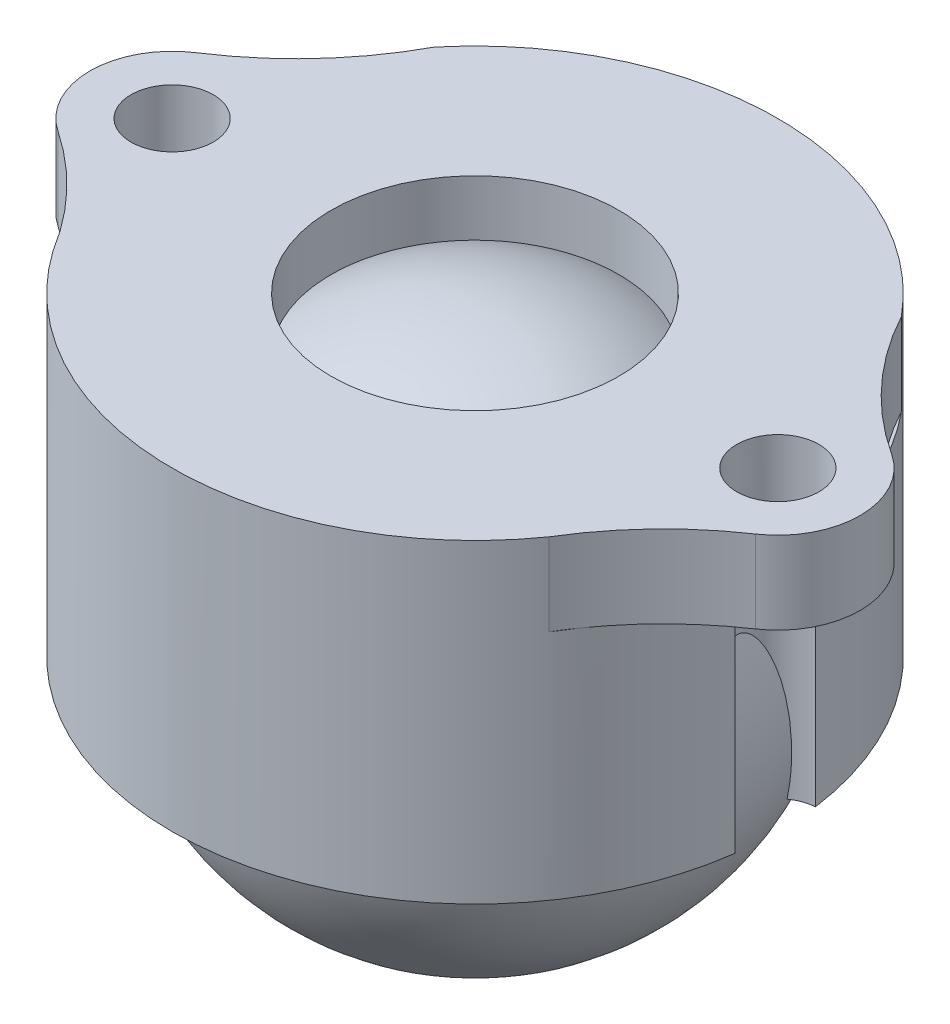
ISO-10303-21;
HEADER;
FILE_DESCRIPTION(('STEP AP214'),'2;1');
FILE_NAME('part.step','',(''),(''),'','','');
FILE_SCHEMA(('AUTOMOTIVE_DESIGN { 1 0 10303 214 1 1 1 1 }'));
ENDSEC;
DATA;
#1=APPLICATION_CONTEXT('core data for automotive mechanical design processes');
#2=APPLICATION_PROTOCOL_DEFINITION('international standard','automotive_design',2000,#1);
#3=PRODUCT_CONTEXT('',#1,'mechanical');
#4=PRODUCT('Part','Part','',(#3));
#5=PRODUCT_RELATED_PRODUCT_CATEGORY('part','',(#4));
#6=PRODUCT_DEFINITION_FORMATION('','',#4);
#7=PRODUCT_DEFINITION_CONTEXT('part definition',#1,'design');
#8=PRODUCT_DEFINITION('design','',#6,#7);
#9=PRODUCT_DEFINITION_SHAPE('','',#8);
#10=(LENGTH_UNIT() NAMED_UNIT(*) SI_UNIT(.MILLI.,.METRE.));
#11=(NAMED_UNIT(*) PLANE_ANGLE_UNIT() SI_UNIT($,.RADIAN.));
#12=(NAMED_UNIT(*) SI_UNIT($,.STERADIAN.) SOLID_ANGLE_UNIT());
#13=UNCERTAINTY_MEASURE_WITH_UNIT(LENGTH_MEASURE(1.E-05),#10,'distance_accuracy_value','');
#14=(GEOMETRIC_REPRESENTATION_CONTEXT(3) GLOBAL_UNCERTAINTY_ASSIGNED_CONTEXT((#13)) GLOBAL_UNIT_ASSIGNED_CONTEXT((#10,
#11,#12)) REPRESENTATION_CONTEXT('',''));
#15=CARTESIAN_POINT('',(0.,0.,0.));
#16=DIRECTION('',(0.,0.,1.));
#17=DIRECTION('',(1.,0.,0.));
#18=AXIS2_PLACEMENT_3D('',#15,#16,#17);
#19=CARTESIAN_POINT('',(-6.83910863974937,-1.008210810104,0.));
#20=DIRECTION('',(0.,-1.,0.));
#21=DIRECTION('',(0.,0.,-1.));
#22=AXIS2_PLACEMENT_3D('',#19,#20,#21);
#23=PLANE('',#22);
#24=CARTESIAN_POINT('',(7.366,-1.008210810104,0.));
#25=DIRECTION('',(0.,-1.,0.));
#26=DIRECTION('',(0.,0.,-1.));
#27=AXIS2_PLACEMENT_3D('',#24,#25,#26);
#28=CIRCLE('',#27,0.982088665650923);
#29=CARTESIAN_POINT('',(6.79248335861352,-1.008210810104,0.797230712687852));
#30=VERTEX_POINT('',#29);
#31=CARTESIAN_POINT('',(7.3005304,-1.008210810104,0.979904015032004));
#32=VERTEX_POINT('',#31);
#33=EDGE_CURVE('E165',#30,#32,#28,.F.);
#34=ORIENTED_EDGE('',*,*,#33,.T.);
#35=CARTESIAN_POINT('',(0.,-1.008210810104,0.));
#36=DIRECTION('',(0.,1.,0.));
#37=DIRECTION('',(0.,0.,1.));
#38=AXIS2_PLACEMENT_3D('',#35,#36,#37);
#39=CIRCLE('',#38,7.366);
#40=CARTESIAN_POINT('',(-7.29812055389628,-1.008210810104,0.997693530497546));
#41=VERTEX_POINT('',#40);
#42=EDGE_CURVE('E178',#41,#32,#39,.T.);
#43=ORIENTED_EDGE('',*,*,#42,.F.);
#44=CARTESIAN_POINT('',(-7.366,-1.008210810104,0.));
#45=DIRECTION('',(0.,-1.,0.));
#46=DIRECTION('',(0.,0.,-1.));
#47=AXIS2_PLACEMENT_3D('',#44,#45,#46);
#48=CIRCLE('',#47,1.);
#49=CARTESIAN_POINT('',(-6.7900735125098,-1.008210810104,0.817501486853212));
#50=VERTEX_POINT('',#49);
#51=EDGE_CURVE('E425',#41,#50,#48,.F.);
#52=ORIENTED_EDGE('',*,*,#51,.T.);
#53=CARTESIAN_POINT('',(0.,-1.008210810104,0.));
#54=DIRECTION('',(0.,1.,0.));
#55=DIRECTION('',(0.,0.,1.));
#56=AXIS2_PLACEMENT_3D('',#53,#54,#55);
#57=CIRCLE('',#56,6.83910863974937);
#58=EDGE_CURVE('E190',#50,#30,#57,.T.);
#59=ORIENTED_EDGE('',*,*,#58,.T.);
#60=EDGE_LOOP('',(#34,#43,#52,#59));
#61=FACE_BOUND('',#60,.T.);
#62=ADVANCED_FACE('F39',(#61),#23,.T.);
#63=CARTESIAN_POINT('',(0.,6.35,0.));
#64=DIRECTION('',(0.,1.,0.));
#65=DIRECTION('',(0.,0.,1.));
#66=AXIS2_PLACEMENT_3D('',#63,#64,#65);
#67=CYLINDRICAL_SURFACE('',#66,7.366);
#68=DIRECTION('',(0.,1.,0.));
#69=VECTOR('',#68,1.);
#70=CARTESIAN_POINT('',(7.3005304,2.820894594948,-0.979904015032012));
#71=LINE('',#70,#69);
#72=CARTESIAN_POINT('',(7.3005304,-1.008210810104,-0.979904015032012));
#73=VERTEX_POINT('',#72);
#74=CARTESIAN_POINT('',(7.3005304,4.65,-0.979904015032016));
#75=VERTEX_POINT('',#74);
#76=EDGE_CURVE('E12',#73,#75,#71,.T.);
#77=ORIENTED_EDGE('',*,*,#76,.F.);
#78=CARTESIAN_POINT('',(-7.29812055389628,-1.008210810104,-0.997693530497546));
#79=VERTEX_POINT('',#78);
#80=EDGE_CURVE('E170',#73,#79,#39,.T.);
#81=ORIENTED_EDGE('',*,*,#80,.T.);
#82=DIRECTION('',(0.,1.,0.));
#83=VECTOR('',#82,1.);
#84=CARTESIAN_POINT('',(-7.29812055389628,2.820894594948,-0.997693530497546));
#85=LINE('',#84,#83);
#86=CARTESIAN_POINT('',(-7.29812055389628,4.65,-0.997693530497544));
#87=VERTEX_POINT('',#86);
#88=EDGE_CURVE('E424',#87,#79,#85,.F.);
#89=ORIENTED_EDGE('',*,*,#88,.F.);
#90=CARTESIAN_POINT('',(0.,4.65,0.));
#91=DIRECTION('',(0.,1.,0.));
#92=DIRECTION('',(0.,0.,1.));
#93=AXIS2_PLACEMENT_3D('',#90,#91,#92);
#94=CIRCLE('',#93,7.366);
#95=CARTESIAN_POINT('',(-6.52433929149894,4.65,-3.41920353436339));
#96=VERTEX_POINT('',#95);
#97=EDGE_CURVE('E215',#96,#87,#94,.T.);
#98=ORIENTED_EDGE('',*,*,#97,.F.);
#99=CARTESIAN_POINT('',(-5.67747566297735,4.65,-4.69299755980119));
#100=VERTEX_POINT('',#99);
#101=EDGE_CURVE('E212',#100,#96,#94,.T.);
#102=ORIENTED_EDGE('',*,*,#101,.F.);
#103=DIRECTION('',(0.,-1.,0.));
#104=VECTOR('',#103,1.);
#105=CARTESIAN_POINT('',(-5.67747566297735,6.65,-4.69299755980119));
#106=LINE('',#105,#104);
#107=CARTESIAN_POINT('',(-5.67747566297735,6.65,-4.69299755980119));
#108=VERTEX_POINT('',#107);
#109=EDGE_CURVE('E264',#108,#100,#106,.T.);
#110=ORIENTED_EDGE('',*,*,#109,.F.);
#111=CARTESIAN_POINT('',(0.,6.65,0.));
#112=DIRECTION('',(0.,1.,0.));
#113=DIRECTION('',(0.,0.,1.));
#114=AXIS2_PLACEMENT_3D('',#111,#112,#113);
#115=CIRCLE('',#114,7.366);
#116=CARTESIAN_POINT('',(5.67747566297735,6.65,-4.69299755980119));
#117=VERTEX_POINT('',#116);
#118=EDGE_CURVE('E262',#117,#108,#115,.T.);
#119=ORIENTED_EDGE('',*,*,#118,.F.);
#120=DIRECTION('',(0.,-1.,0.));
#121=VECTOR('',#120,1.);
#122=CARTESIAN_POINT('',(5.67747566297735,6.65,-4.69299755980119));
#123=LINE('',#122,#121);
#124=CARTESIAN_POINT('',(5.67747566297735,4.65,-4.69299755980119));
#125=VERTEX_POINT('',#124);
#126=EDGE_CURVE('E253',#117,#125,#123,.T.);
#127=ORIENTED_EDGE('',*,*,#126,.T.);
#128=CARTESIAN_POINT('',(6.52433929149894,4.65,-3.41920353436339));
#129=VERTEX_POINT('',#128);
#130=EDGE_CURVE('E209',#129,#125,#94,.T.);
#131=ORIENTED_EDGE('',*,*,#130,.F.);
#132=CARTESIAN_POINT('',(7.29812055389628,4.65,-0.997693530497546));
#133=VERTEX_POINT('',#132);
#134=EDGE_CURVE('E206',#133,#129,#94,.T.);
#135=ORIENTED_EDGE('',*,*,#134,.F.);
#136=EDGE_CURVE('E173',#75,#133,#94,.T.);
#137=ORIENTED_EDGE('',*,*,#136,.F.);
#138=EDGE_LOOP('',(#77,#81,#89,#98,#102,#110,#119,#127,#131,#135,#137));
#139=FACE_BOUND('',#138,.T.);
#140=ADVANCED_FACE('F169',(#139),#67,.T.);
#141=CARTESIAN_POINT('',(-7.366,4.65,0.));
#142=DIRECTION('',(0.,1.,0.));
#143=DIRECTION('',(0.,0.,1.));
#144=AXIS2_PLACEMENT_3D('',#141,#142,#143);
#145=PLANE('',#144);
#146=CARTESIAN_POINT('',(-12.9690707269742,4.65,-8.62230005406383));
#147=DIRECTION('',(0.,-1.,0.));
#148=DIRECTION('',(0.,0.,1.));
#149=AXIS2_PLACEMENT_3D('',#146,#147,#148);
#150=CIRCLE('',#149,8.28292078126563);
#151=EDGE_CURVE('E306',#100,#96,#150,.T.);
#152=ORIENTED_EDGE('',*,*,#151,.F.);
#153=ORIENTED_EDGE('',*,*,#101,.T.);
#154=EDGE_LOOP('',(#152,#153));
#155=FACE_BOUND('',#154,.T.);
#156=ADVANCED_FACE('F405',(#155),#145,.T.);
#157=CARTESIAN_POINT('',(12.9690707269742,4.65,-8.62230005406384));
#158=DIRECTION('',(0.,-1.,0.));
#159=DIRECTION('',(0.,0.,-1.));
#160=AXIS2_PLACEMENT_3D('',#157,#158,#159);
#161=CIRCLE('',#160,8.28292078126563);
#162=EDGE_CURVE('E225',#129,#125,#161,.T.);
#163=ORIENTED_EDGE('',*,*,#162,.F.);
#164=ORIENTED_EDGE('',*,*,#130,.T.);
#165=EDGE_LOOP('',(#163,#164));
#166=FACE_BOUND('',#165,.T.);
#167=ADVANCED_FACE('F265',(#166),#145,.T.);
#168=CARTESIAN_POINT('',(13.1103055993483,4.65,8.52885765944539));
#169=DIRECTION('',(0.,-1.,0.));
#170=DIRECTION('',(0.,0.,1.));
#171=AXIS2_PLACEMENT_3D('',#168,#169,#170);
#172=CIRCLE('',#171,8.28292078126562);
#173=CARTESIAN_POINT('',(6.02995004834117,4.65,4.23056242295399));
#174=VERTEX_POINT('',#173);
#175=CARTESIAN_POINT('',(6.31134136356854,4.65,3.79801608639416));
#176=VERTEX_POINT('',#175);
#177=EDGE_CURVE('E238',#174,#176,#172,.T.);
#178=ORIENTED_EDGE('',*,*,#177,.F.);
#179=EDGE_CURVE('E179',#174,#176,#94,.T.);
#180=ORIENTED_EDGE('',*,*,#179,.T.);
#181=EDGE_LOOP('',(#178,#180));
#182=FACE_BOUND('',#181,.T.);
#183=ADVANCED_FACE('F454',(#182),#145,.T.);
#184=CARTESIAN_POINT('',(7.366,4.65,0.));
#185=DIRECTION('',(0.,1.,0.));
#186=DIRECTION('',(0.,0.,1.));
#187=AXIS2_PLACEMENT_3D('',#184,#185,#186);
#188=CIRCLE('',#187,0.982088665650923);
#189=CARTESIAN_POINT('',(7.3005304,4.65,0.979904015032004));
#190=VERTEX_POINT('',#189);
#191=EDGE_CURVE('E54',#75,#190,#188,.T.);
#192=ORIENTED_EDGE('',*,*,#191,.F.);
#193=ORIENTED_EDGE('',*,*,#136,.T.);
#194=CARTESIAN_POINT('',(7.366,4.65,0.));
#195=DIRECTION('',(0.,1.,0.));
#196=DIRECTION('',(0.,0.,-1.));
#197=AXIS2_PLACEMENT_3D('',#194,#195,#196);
#198=CIRCLE('',#197,1.);
#199=CARTESIAN_POINT('',(7.29812055389628,4.65,0.997693530497541));
#200=VERTEX_POINT('',#199);
#201=EDGE_CURVE('E335',#133,#200,#198,.T.);
#202=ORIENTED_EDGE('',*,*,#201,.T.);
#203=EDGE_CURVE('E203',#200,#190,#94,.T.);
#204=ORIENTED_EDGE('',*,*,#203,.T.);
#205=EDGE_LOOP('',(#192,#193,#202,#204));
#206=FACE_BOUND('',#205,.T.);
#207=ADVANCED_FACE('F406',(#206),#145,.T.);
#208=CARTESIAN_POINT('',(0.,0.,0.));
#209=DIRECTION('',(0.,1.,0.));
#210=DIRECTION('',(-1.,0.,0.));
#211=AXIS2_PLACEMENT_3D('',#208,#209,#210);
#212=SPHERICAL_SURFACE('',#211,6.91302365278067);
#213=CARTESIAN_POINT('',(6.79245598118181,-1.00841081010399,0.79721101703243));
#214=CARTESIAN_POINT('',(6.80364530632527,-0.926705677484879,0.805232688908091));
#215=CARTESIAN_POINT('',(6.8135082430222,-0.844704379796934,0.81199979153664));
#216=CARTESIAN_POINT('',(6.83052664889354,-0.68027806432814,0.823336415411445));
#217=CARTESIAN_POINT('',(6.83768241814655,-0.597853094536855,0.827906180238978));
#218=CARTESIAN_POINT('',(6.84924081818927,-0.432636735810129,0.835165417481351));
#219=CARTESIAN_POINT('',(6.85364033466358,-0.349845038451591,0.83785276333693));
#220=CARTESIAN_POINT('',(6.85964695265033,-0.184120208180288,0.84149740848753));
#221=CARTESIAN_POINT('',(6.86125396906029,-0.101187071034188,0.842454655057167));
#222=CARTESIAN_POINT('',(6.86166709460524,0.0655495387035506,0.842701802059498));
#223=CARTESIAN_POINT('',(6.86044395832455,0.14935311014109,0.841974292985238));
#224=CARTESIAN_POINT('',(6.85514397649867,0.316836333162014,0.838769323030744));
#225=CARTESIAN_POINT('',(6.85106715404747,0.400515985742743,0.836291876312218));
#226=CARTESIAN_POINT('',(6.84008978927661,0.567558046508765,0.829432686761025));
#227=CARTESIAN_POINT('',(6.83319109075042,0.650920626038043,0.825052187253534));
#228=CARTESIAN_POINT('',(6.81661835179339,0.817217683100822,0.814111070803616));
#229=CARTESIAN_POINT('',(6.80694466458543,0.900152213752964,0.807550731311944));
#230=CARTESIAN_POINT('',(6.78505291259643,1.06423072332394,0.791945155105632));
#231=CARTESIAN_POINT('',(6.77287340702135,1.1453833069759,0.782936980024998));
#232=CARTESIAN_POINT('',(6.74599036779569,1.30688365982457,0.761826139158384));
#233=CARTESIAN_POINT('',(6.73128645686092,1.38723130681727,0.749723010684604));
#234=CARTESIAN_POINT('',(6.6995233772409,1.5467139156324,0.721635795799902));
#235=CARTESIAN_POINT('',(6.68246640033434,1.62584993070207,0.705655310587986));
#236=CARTESIAN_POINT('',(6.64624750449199,1.78240314302272,0.668673879580945));
#237=CARTESIAN_POINT('',(6.62708712064664,1.8598215448523,0.6476765821187));
#238=CARTESIAN_POINT('',(6.58693989149238,2.01255802008704,0.598818817442239));
#239=CARTESIAN_POINT('',(6.5659442655152,2.08786343176323,0.57092404061953));
#240=CARTESIAN_POINT('',(6.5338545020906,2.19725806561568,0.521922451407796));
#241=CARTESIAN_POINT('',(6.52308104479899,2.23305979412997,0.50443814253645));
#242=CARTESIAN_POINT('',(6.50152598666905,2.3030612308688,0.466541691808131));
#243=CARTESIAN_POINT('',(6.49074440602504,2.33726257009015,0.446132620831363));
#244=CARTESIAN_POINT('',(6.47210023637997,2.39520253157544,0.407166624840402));
#245=CARTESIAN_POINT('',(6.46417296088144,2.4194427791929,0.389392328042559));
#246=CARTESIAN_POINT('',(6.44868849682826,2.46613451667752,0.351369142117093));
#247=CARTESIAN_POINT('',(6.44113193867168,2.48858299771884,0.331116229445804));
#248=CARTESIAN_POINT('',(6.42665231892134,2.53108035569557,0.287505099915992));
#249=CARTESIAN_POINT('',(6.41973733986956,2.55109939837542,0.264114513858078));
#250=CARTESIAN_POINT('',(6.40718656397143,2.58708409522896,0.214088051651398));
#251=CARTESIAN_POINT('',(6.40154653597921,2.60306317826265,0.187463374557259));
#252=CARTESIAN_POINT('',(6.39394423892896,2.62446926201605,0.141214419816116));
#253=CARTESIAN_POINT('',(6.39138810421987,2.63162615355026,0.122493757130198));
#254=CARTESIAN_POINT('',(6.38732557021922,2.64297295978893,0.0840616164620585));
#255=CARTESIAN_POINT('',(6.38581803492282,2.64716608538224,0.0643512356032779));
#256=CARTESIAN_POINT('',(6.38400760623739,2.65219923723043,0.0243301042128601));
#257=CARTESIAN_POINT('',(6.38371141627958,2.65302060469744,0.00401663775724779));
#258=CARTESIAN_POINT('',(6.3843787310897,2.65116712174218,-0.0364308277319489));
#259=CARTESIAN_POINT('',(6.38534257624613,2.6484913265892,-0.0565647767907891));
#260=CARTESIAN_POINT('',(6.38831467249377,2.64021158935985,-0.0947223751209542));
#261=CARTESIAN_POINT('',(6.39024984694579,2.63481241325548,-0.112797625259818));
#262=CARTESIAN_POINT('',(6.39495418359206,2.62162782241367,-0.147928365947964));
#263=CARTESIAN_POINT('',(6.39772368844496,2.61384142722446,-0.164983434053562));
#264=CARTESIAN_POINT('',(6.40584531962391,2.59087621159452,-0.208186920583066));
#265=CARTESIAN_POINT('',(6.41173210645472,2.57411240698139,-0.233389517173959));
#266=CARTESIAN_POINT('',(6.42457960068723,2.53708387109059,-0.280768528859039));
#267=CARTESIAN_POINT('',(6.43154361916955,2.51680832197419,-0.302935202433373));
#268=CARTESIAN_POINT('',(6.45181619283057,2.45696009733923,-0.361018692381437));
#269=CARTESIAN_POINT('',(6.46579562912843,2.41478315299873,-0.393986474455198));
#270=CARTESIAN_POINT('',(6.49426035234998,2.32634816881479,-0.453484432489463));
#271=CARTESIAN_POINT('',(6.50874684627208,2.28007992540673,-0.479997856784123));
#272=CARTESIAN_POINT('',(6.54266560382925,2.16816422931932,-0.536722750349181));
#273=CARTESIAN_POINT('',(6.56202524100956,2.10147496308299,-0.564897985766624));
#274=CARTESIAN_POINT('',(6.59959446927944,1.96539760213545,-0.614889408274346));
#275=CARTESIAN_POINT('',(6.61780178998999,1.8960045896316,-0.636693330074786));
#276=CARTESIAN_POINT('',(6.65271266417276,1.75515656074008,-0.675576683838802));
#277=CARTESIAN_POINT('',(6.66940809710803,1.6836928508925,-0.692631518934077));
#278=CARTESIAN_POINT('',(6.70092778797547,1.53963446633848,-0.722947313868131));
#279=CARTESIAN_POINT('',(6.71575339755858,1.46704065170158,-0.736211023107071));
#280=CARTESIAN_POINT('',(6.74380548990007,1.31881238530903,-0.760079892045045));
#281=CARTESIAN_POINT('',(6.75697097232639,1.24315188267459,-0.770593797383315));
#282=CARTESIAN_POINT('',(6.78105589842482,1.091155679059,-0.789028193723616));
#283=CARTESIAN_POINT('',(6.79197491676615,1.01481985306488,-0.796948193780334));
#284=CARTESIAN_POINT('',(6.82125218448607,0.784943113434108,-0.817517794947797));
#285=CARTESIAN_POINT('',(6.83610816283058,0.630650825642363,-0.826959649400793));
#286=CARTESIAN_POINT('',(6.85607850089065,0.321624177711567,-0.839407918276185));
#287=CARTESIAN_POINT('',(6.86121793620255,0.16689199041966,-0.842430900449503));
#288=CARTESIAN_POINT('',(6.86172600966134,-0.142496918159366,-0.842739258065743));
#289=CARTESIAN_POINT('',(6.8571020272245,-0.297153608134662,-0.840028966846052));
#290=CARTESIAN_POINT('',(6.8419314171585,-0.544742351181046,-0.830598162835948));
#291=CARTESIAN_POINT('',(6.83444182281538,-0.637949728045888,-0.82588207563839));
#292=CARTESIAN_POINT('',(6.81601319106808,-0.823696244741167,-0.813707226000521));
#293=CARTESIAN_POINT('',(6.80507945387572,-0.916236189339928,-0.806252674888329));
#294=CARTESIAN_POINT('',(6.79245598118181,-1.008410810104,-0.797211017032437));
#295=B_SPLINE_CURVE_WITH_KNOTS('',3,(#213,#214,#215,#216,#217,#218,#219,#220,#221,#222,#223,
#224,#225,#226,#227,#228,#229,#230,#231,#232,#233,#234,#235,#236,#237,#238,#239,#240,#241,#242,
#243,#244,#245,#246,#247,#248,#249,#250,#251,#252,#253,#254,#255,#256,#257,#258,#259,#260,#261,
#262,#263,#264,#265,#266,#267,#268,#269,#270,#271,#272,#273,#274,#275,#276,#277,#278,#279,#280,
#281,#282,#283,#284,#285,#286,#287,#288,#289,#290,#291,#292,#293,#294),.UNSPECIFIED.,.F.,.F.,(4,
2,2,2,2,2,2,2,2,2,2,2,2,2,2,2,2,2,2,2,2,2,2,2,2,2,2,2,2,2,2,2,2,2,2,2,2,2,2,2,4),(0.,
0.248537922629963,0.497048287754279,0.745838942985535,0.99463718007193,1.24601784201047,
1.49739646962587,1.74861110995838,1.99979378784874,2.24736706732381,2.49497738004552,
2.74235859250917,2.9895604487274,3.23801759116001,3.36174378780858,3.48534101608095,
3.57848536544141,3.67178297337833,3.76613010146539,3.86015936893784,3.92054617884261,
3.98086746610715,4.04152211571981,4.10219315409154,4.15886263104339,4.21555541389546,
4.30752771499255,4.39978854404567,4.56483741781153,4.73031019911883,4.95460981708962,
5.1793384273155,5.4052101936362,5.63091773519268,5.8633677745382,6.0958617840305,
6.56121241345999,7.0253604589942,7.48915781631429,7.76994262265755,8.05029742138466),.UNSPECIFIED.);
#296=CARTESIAN_POINT('',(6.79248335861352,-1.008210810104,-0.797230712687859));
#297=VERTEX_POINT('',#296);
#298=EDGE_CURVE('E161',#30,#297,#295,.T.);
#299=ORIENTED_EDGE('',*,*,#298,.F.);
#300=ORIENTED_EDGE('',*,*,#58,.F.);
#301=CARTESIAN_POINT('',(-6.79004613507809,-1.00841081010399,-0.817482198877455));
#302=CARTESIAN_POINT('',(-6.80144272257187,-0.925193105543932,-0.825482687881289));
#303=CARTESIAN_POINT('',(-6.8114625337938,-0.841673506914083,-0.832214857650883));
#304=CARTESIAN_POINT('',(-6.82869237068195,-0.674203794723808,-0.843456436113508));
#305=CARTESIAN_POINT('',(-6.83590269354431,-0.590253727652015,-0.847966079925393));
#306=CARTESIAN_POINT('',(-6.84746672658336,-0.421977235532006,-0.855082333468163));
#307=CARTESIAN_POINT('',(-6.85181698029971,-0.337650478641722,-0.85768664098261));
#308=CARTESIAN_POINT('',(-6.85762016063199,-0.168859330997471,-0.861140052155232));
#309=CARTESIAN_POINT('',(-6.85907300359081,-0.0843949363399471,-0.861989105133866));
#310=CARTESIAN_POINT('',(-6.85907143788861,0.085463828990609,-0.861987954492522));
#311=CARTESIAN_POINT('',(-6.85758484629386,0.17085820055638,-0.861118940315992));
#312=CARTESIAN_POINT('',(-6.85164982441744,0.341506669279555,-0.857587282813851));
#313=CARTESIAN_POINT('',(-6.8472014204775,0.426760767677758,-0.854924655440248));
#314=CARTESIAN_POINT('',(-6.83537659005716,0.596923557186075,-0.847636206279228));
#315=CARTESIAN_POINT('',(-6.82800219287597,0.681832446568661,-0.843011744952588));
#316=CARTESIAN_POINT('',(-6.8103786678195,0.851188890370347,-0.831502267702406));
#317=CARTESIAN_POINT('',(-6.80012992245922,0.935636504651963,-0.8246175525501));
#318=CARTESIAN_POINT('',(-6.77700916268886,1.1026430777459,-0.808262203647416));
#319=CARTESIAN_POINT('',(-6.76417809500617,1.18521151669206,-0.798831232708669));
#320=CARTESIAN_POINT('',(-6.73591371339262,1.34948828550595,-0.776732861291353));
#321=CARTESIAN_POINT('',(-6.72047994263985,1.43119646170244,-0.764064892459092));
#322=CARTESIAN_POINT('',(-6.68719281954179,1.59332628464172,-0.73465368140605));
#323=CARTESIAN_POINT('',(-6.6693414611474,1.67374893117008,-0.717913788617062));
#324=CARTESIAN_POINT('',(-6.63149745454485,1.83274365871497,-0.679146678796483));
#325=CARTESIAN_POINT('',(-6.61150651456248,1.91131715582805,-0.657123662585702));
#326=CARTESIAN_POINT('',(-6.56968186170048,2.06622902515901,-0.605802918556859));
#327=CARTESIAN_POINT('',(-6.54783805320071,2.14255163381935,-0.576463389370849));
#328=CARTESIAN_POINT('',(-6.51456825875132,2.25313013976725,-0.524853642906776));
#329=CARTESIAN_POINT('',(-6.50342013317726,2.28926127700382,-0.506433909411031));
#330=CARTESIAN_POINT('',(-6.48117206432782,2.35975836330182,-0.466482309852705));
#331=CARTESIAN_POINT('',(-6.47007207948332,2.39412636324832,-0.444954176087024));
#332=CARTESIAN_POINT('',(-6.45129529344339,2.45111069300389,-0.404552835522223));
#333=CARTESIAN_POINT('',(-6.44352280264383,2.4743429629951,-0.386598906575437));
#334=CARTESIAN_POINT('',(-6.42838965371243,2.518990540643,-0.34829859125248));
#335=CARTESIAN_POINT('',(-6.42102961728848,2.54040312925165,-0.327948729353359));
#336=CARTESIAN_POINT('',(-6.40698436215792,2.58080807902751,-0.284290856908164));
#337=CARTESIAN_POINT('',(-6.40030711318512,2.59977241552358,-0.260953807850626));
#338=CARTESIAN_POINT('',(-6.38823742280475,2.63374761323421,-0.211254714453844));
#339=CARTESIAN_POINT('',(-6.38284127390954,2.64876989632692,-0.184901734521949));
#340=CARTESIAN_POINT('',(-6.37544785523147,2.66923648277986,-0.138439030442357));
#341=CARTESIAN_POINT('',(-6.37291599712154,2.67620676212838,-0.119091460118151));
#342=CARTESIAN_POINT('',(-6.36896201252179,2.68706783682583,-0.0794393104488874));
#343=CARTESIAN_POINT('',(-6.36753869958055,2.6909619246186,-0.0591357790061139));
#344=CARTESIAN_POINT('',(-6.3659495442082,2.6953086298388,-0.0180054250650283));
#345=CARTESIAN_POINT('',(-6.36578984263625,2.69574444087028,0.00282346002395707));
#346=CARTESIAN_POINT('',(-6.36676362644848,2.6930822136767,0.0442251358798858));
#347=CARTESIAN_POINT('',(-6.36789758289611,2.68998288819222,0.0647978306011653));
#348=CARTESIAN_POINT('',(-6.37123135473009,2.6808376504203,0.103921225265489));
#349=CARTESIAN_POINT('',(-6.37336671912031,2.67496979866512,0.122520334757626));
#350=CARTESIAN_POINT('',(-6.37849389575182,2.66081383067919,0.15863445508998));
#351=CARTESIAN_POINT('',(-6.38148603773659,2.65252478259065,0.176149045374443));
#352=CARTESIAN_POINT('',(-6.39029794441482,2.62796746366309,0.220939347002586));
#353=CARTESIAN_POINT('',(-6.39669263684299,2.61001178573423,0.247174015162426));
#354=CARTESIAN_POINT('',(-6.41059746861113,2.57047201980694,0.296417589972263));
#355=CARTESIAN_POINT('',(-6.41811112617701,2.54887645807724,0.319415860441764));
#356=CARTESIAN_POINT('',(-6.44001487335761,2.48499857235276,0.379829746968549));
#357=CARTESIAN_POINT('',(-6.45509940939685,2.43998249638471,0.414069227934325));
#358=CARTESIAN_POINT('',(-6.48572614740122,2.34571745775906,0.475702686812309));
#359=CARTESIAN_POINT('',(-6.50126941749049,2.29645800275542,0.503079001476945));
#360=CARTESIAN_POINT('',(-6.53759353192282,2.17731739081569,0.561533239309063));
#361=CARTESIAN_POINT('',(-6.55826342976782,2.10635182396998,0.590444130665926));
#362=CARTESIAN_POINT('',(-6.59823290521879,1.96162066757318,0.641541322831328));
#363=CARTESIAN_POINT('',(-6.61752979659359,1.8878500001888,0.663714704794199));
#364=CARTESIAN_POINT('',(-6.65437664944246,1.73816112789579,0.703079652417562));
#365=CARTESIAN_POINT('',(-6.67191720921568,1.66223389617992,0.720245259683842));
#366=CARTESIAN_POINT('',(-6.70485977413957,1.50920916082658,0.750594833613683));
#367=CARTESIAN_POINT('',(-6.72026330129972,1.43211253390528,0.76378164195109));
#368=CARTESIAN_POINT('',(-6.74881285690649,1.27686295426635,0.787032135065367));
#369=CARTESIAN_POINT('',(-6.76195384143026,1.19870804989387,0.797088881216316));
#370=CARTESIAN_POINT('',(-6.78582661721406,1.04173937589484,0.814625757768475));
#371=CARTESIAN_POINT('',(-6.79655798005739,0.962925491685113,0.822105430107115));
#372=CARTESIAN_POINT('',(-6.82502774083733,0.725637117903327,0.841364095011091));
#373=CARTESIAN_POINT('',(-6.83902007163063,0.566433206430739,0.849946705216207));
#374=CARTESIAN_POINT('',(-6.85662665904949,0.247736849842018,0.860600565478689));
#375=CARTESIAN_POINT('',(-6.86027043997566,0.0882465272055069,0.862690341128975));
#376=CARTESIAN_POINT('',(-6.85718719854482,-0.230500811556867,0.860882630009992));
#377=CARTESIAN_POINT('',(-6.85046849660323,-0.389757912198019,0.856989946784061));
#378=CARTESIAN_POINT('',(-6.83291812550438,-0.625499428058896,0.846087433685075));
#379=CARTESIAN_POINT('',(-6.82598055776482,-0.702417297253064,0.841711466882896));
#380=CARTESIAN_POINT('',(-6.80975941778578,-0.855775712799912,0.83107482295485));
#381=CARTESIAN_POINT('',(-6.80047879077711,-0.932216735849288,0.824816510066468));
#382=CARTESIAN_POINT('',(-6.79004613507809,-1.00841081010399,0.817482198877455));
#383=B_SPLINE_CURVE_WITH_KNOTS('',3,(#301,#302,#303,#304,#305,#306,#307,#308,#309,#310,#311,
#312,#313,#314,#315,#316,#317,#318,#319,#320,#321,#322,#323,#324,#325,#326,#327,#328,#329,#330,
#331,#332,#333,#334,#335,#336,#337,#338,#339,#340,#341,#342,#343,#344,#345,#346,#347,#348,#349,
#350,#351,#352,#353,#354,#355,#356,#357,#358,#359,#360,#361,#362,#363,#364,#365,#366,#367,#368,
#369,#370,#371,#372,#373,#374,#375,#376,#377,#378,#379,#380,#381,#382),.UNSPECIFIED.,.F.,.F.,(4,
2,2,2,2,2,2,2,2,2,2,2,2,2,2,2,2,2,2,2,2,2,2,2,2,2,2,2,2,2,2,2,2,2,2,2,2,2,2,2,4),(0.,
0.253090308524514,0.506153837121874,0.759522639450091,1.01289875720476,1.26906437185035,
1.52522770824418,1.78121369427624,2.03716563013486,2.28934019576642,2.54155906879357,
2.79357117224164,3.04538355122461,3.29866896041227,3.42474176243881,3.55066442697913,
3.64166769219459,3.73280463136099,3.82490649129538,3.91673846874967,3.978660391078,
4.04051594831831,4.10267192575288,4.16485054344975,4.22348431337185,4.28214067976402,
4.37885981770775,4.47588974212621,4.65050508368824,4.82556531063214,5.0631156536193,
5.30111865451798,5.54033430085034,5.77937869179879,6.01894927571731,6.25856242022233,
6.73814865342607,7.2163652511002,7.69419807107784,7.92620885104769,8.15792943247112),.UNSPECIFIED.);
#384=CARTESIAN_POINT('',(-6.7900735125098,-1.008210810104,-0.817501486853212));
#385=VERTEX_POINT('',#384);
#386=EDGE_CURVE('E344',#385,#50,#383,.T.);
#387=ORIENTED_EDGE('',*,*,#386,.F.);
#388=EDGE_CURVE('E182',#297,#385,#57,.T.);
#389=ORIENTED_EDGE('',*,*,#388,.F.);
#390=EDGE_LOOP('',(#299,#300,#387,#389));
#391=FACE_BOUND('',#390,.T.);
#392=CARTESIAN_POINT('',(0.,3.85775919348449,0.));
#393=DIRECTION('',(0.,1.,0.));
#394=DIRECTION('',(0.,0.,1.));
#395=AXIS2_PLACEMENT_3D('',#392,#393,#394);
#396=CIRCLE('',#395,5.73651375218354);
#397=CARTESIAN_POINT('',(0.,3.85775919348449,5.73651375218354));
#398=VERTEX_POINT('',#397);
#399=EDGE_CURVE('E222',#398,#398,#396,.T.);
#400=ORIENTED_EDGE('',*,*,#399,.T.);
#401=EDGE_LOOP('',(#400));
#402=FACE_BOUND('',#401,.T.);
#403=ADVANCED_FACE('F41',(#391,#402),#212,.F.);
#404=EDGE_CURVE('E157',#73,#297,#28,.F.);
#405=ORIENTED_EDGE('',*,*,#404,.T.);
#406=ORIENTED_EDGE('',*,*,#388,.T.);
#407=EDGE_CURVE('E177',#385,#79,#48,.F.);
#408=ORIENTED_EDGE('',*,*,#407,.T.);
#409=ORIENTED_EDGE('',*,*,#80,.F.);
#410=EDGE_LOOP('',(#405,#406,#408,#409));
#411=FACE_BOUND('',#410,.T.);
#412=ADVANCED_FACE('F175',(#411),#23,.T.);
#413=DIRECTION('',(0.,1.,0.));
#414=VECTOR('',#413,1.);
#415=CARTESIAN_POINT('',(7.3005304,2.820894594948,0.979904015032004));
#416=LINE('',#415,#414);
#417=EDGE_CURVE('E48',#190,#32,#416,.F.);
#418=ORIENTED_EDGE('',*,*,#417,.F.);
#419=ORIENTED_EDGE('',*,*,#203,.F.);
#420=EDGE_CURVE('E184',#176,#200,#94,.T.);
#421=ORIENTED_EDGE('',*,*,#420,.F.);
#422=ORIENTED_EDGE('',*,*,#179,.F.);
#423=DIRECTION('',(0.,-1.,0.));
#424=VECTOR('',#423,1.);
#425=CARTESIAN_POINT('',(6.02995004834117,6.65,4.23056242295399));
#426=LINE('',#425,#424);
#427=CARTESIAN_POINT('',(6.02995004834117,6.65,4.23056242295399));
#428=VERTEX_POINT('',#427);
#429=EDGE_CURVE('E299',#428,#174,#426,.T.);
#430=ORIENTED_EDGE('',*,*,#429,.F.);
#431=CARTESIAN_POINT('',(0.,6.65,0.));
#432=DIRECTION('',(0.,1.,0.));
#433=DIRECTION('',(0.,0.,1.));
#434=AXIS2_PLACEMENT_3D('',#431,#432,#433);
#435=CIRCLE('',#434,7.366);
#436=CARTESIAN_POINT('',(-6.02995004834117,6.65,4.23056242295399));
#437=VERTEX_POINT('',#436);
#438=EDGE_CURVE('E298',#437,#428,#435,.T.);
#439=ORIENTED_EDGE('',*,*,#438,.F.);
#440=DIRECTION('',(0.,-1.,0.));
#441=VECTOR('',#440,1.);
#442=CARTESIAN_POINT('',(-6.02995004834117,6.65,4.23056242295399));
#443=LINE('',#442,#441);
#444=CARTESIAN_POINT('',(-6.02995004834117,4.65,4.23056242295399));
#445=VERTEX_POINT('',#444);
#446=EDGE_CURVE('E296',#437,#445,#443,.T.);
#447=ORIENTED_EDGE('',*,*,#446,.T.);
#448=CARTESIAN_POINT('',(-6.31134136356854,4.65,3.79801608639416));
#449=VERTEX_POINT('',#448);
#450=EDGE_CURVE('E219',#449,#445,#94,.T.);
#451=ORIENTED_EDGE('',*,*,#450,.F.);
#452=CARTESIAN_POINT('',(-7.29812055389628,4.65,0.997693530497546));
#453=VERTEX_POINT('',#452);
#454=EDGE_CURVE('E217',#453,#449,#94,.T.);
#455=ORIENTED_EDGE('',*,*,#454,.F.);
#456=DIRECTION('',(0.,1.,0.));
#457=VECTOR('',#456,1.);
#458=CARTESIAN_POINT('',(-7.29812055389628,2.820894594948,0.997693530497546));
#459=LINE('',#458,#457);
#460=EDGE_CURVE('E352',#41,#453,#459,.T.);
#461=ORIENTED_EDGE('',*,*,#460,.F.);
#462=ORIENTED_EDGE('',*,*,#42,.T.);
#463=EDGE_LOOP('',(#418,#419,#421,#422,#430,#439,#447,#451,#455,#461,#462));
#464=FACE_BOUND('',#463,.T.);
#465=ADVANCED_FACE('F294',(#464),#67,.T.);
#466=CARTESIAN_POINT('',(-13.1103055993483,4.65,8.5288576594454));
#467=DIRECTION('',(0.,-1.,0.));
#468=DIRECTION('',(0.,0.,-1.));
#469=AXIS2_PLACEMENT_3D('',#466,#467,#468);
#470=CIRCLE('',#469,8.28292078126562);
#471=EDGE_CURVE('E192',#449,#445,#470,.T.);
#472=ORIENTED_EDGE('',*,*,#471,.F.);
#473=ORIENTED_EDGE('',*,*,#450,.T.);
#474=EDGE_LOOP('',(#472,#473));
#475=FACE_BOUND('',#474,.T.);
#476=ADVANCED_FACE('F293',(#475),#145,.T.);
#477=CARTESIAN_POINT('',(0.,6.35,0.));
#478=DIRECTION('',(0.,1.,0.));
#479=DIRECTION('',(0.,0.,1.));
#480=AXIS2_PLACEMENT_3D('',#477,#478,#479);
#481=CYLINDRICAL_SURFACE('',#480,5.73651375218354);
#482=CARTESIAN_POINT('',(0.,4.65,0.));
#483=DIRECTION('',(0.,1.,0.));
#484=DIRECTION('',(0.,0.,1.));
#485=AXIS2_PLACEMENT_3D('',#482,#483,#484);
#486=CIRCLE('',#485,5.73651375218354);
#487=CARTESIAN_POINT('',(0.,4.65,5.73651375218354));
#488=VERTEX_POINT('',#487);
#489=EDGE_CURVE('E188',#488,#488,#486,.T.);
#490=ORIENTED_EDGE('',*,*,#489,.T.);
#491=EDGE_LOOP('',(#490));
#492=FACE_BOUND('',#491,.T.);
#493=ORIENTED_EDGE('',*,*,#399,.F.);
#494=EDGE_LOOP('',(#493));
#495=FACE_BOUND('',#494,.T.);
#496=ADVANCED_FACE('F399',(#492,#495),#481,.F.);
#497=CARTESIAN_POINT('',(-6.4845353634871,4.65,-4.31115002703192));
#498=DIRECTION('',(0.,1.,0.));
#499=DIRECTION('',(0.,0.,1.));
#500=AXIS2_PLACEMENT_3D('',#497,#498,#499);
#501=PLANE('',#500);
#502=CARTESIAN_POINT('',(8.48325174617971,4.65,1.65883951473866));
#503=VERTEX_POINT('',#502);
#504=EDGE_CURVE('E233',#176,#503,#172,.T.);
#505=ORIENTED_EDGE('',*,*,#504,.F.);
#506=ORIENTED_EDGE('',*,*,#420,.T.);
#507=EDGE_CURVE('E61',#200,#133,#198,.T.);
#508=ORIENTED_EDGE('',*,*,#507,.T.);
#509=ORIENTED_EDGE('',*,*,#134,.T.);
#510=CARTESIAN_POINT('',(8.45578194934311,4.65,-1.67701380521627));
#511=VERTEX_POINT('',#510);
#512=EDGE_CURVE('E257',#511,#129,#161,.T.);
#513=ORIENTED_EDGE('',*,*,#512,.F.);
#514=CARTESIAN_POINT('',(7.366,4.65,0.));
#515=DIRECTION('',(0.,1.,0.));
#516=DIRECTION('',(0.,0.,-1.));
#517=AXIS2_PLACEMENT_3D('',#514,#515,#516);
#518=CIRCLE('',#517,2.);
#519=EDGE_CURVE('E239',#503,#511,#518,.T.);
#520=ORIENTED_EDGE('',*,*,#519,.F.);
#521=EDGE_LOOP('',(#505,#506,#508,#509,#513,#520));
#522=FACE_BOUND('',#521,.T.);
#523=ADVANCED_FACE('F379',(#522),#501,.F.);
#524=CARTESIAN_POINT('',(-8.45578194934311,4.65,-1.67701380521627));
#525=VERTEX_POINT('',#524);
#526=EDGE_CURVE('E310',#96,#525,#150,.T.);
#527=ORIENTED_EDGE('',*,*,#526,.F.);
#528=ORIENTED_EDGE('',*,*,#97,.T.);
#529=CARTESIAN_POINT('',(-7.366,4.65,0.));
#530=DIRECTION('',(0.,1.,0.));
#531=DIRECTION('',(0.,0.,1.));
#532=AXIS2_PLACEMENT_3D('',#529,#530,#531);
#533=CIRCLE('',#532,1.);
#534=EDGE_CURVE('E279',#87,#453,#533,.T.);
#535=ORIENTED_EDGE('',*,*,#534,.T.);
#536=ORIENTED_EDGE('',*,*,#454,.T.);
#537=CARTESIAN_POINT('',(-8.4832517461797,4.65,1.65883951473867));
#538=VERTEX_POINT('',#537);
#539=EDGE_CURVE('E228',#538,#449,#470,.T.);
#540=ORIENTED_EDGE('',*,*,#539,.F.);
#541=CARTESIAN_POINT('',(-7.366,4.65,0.));
#542=DIRECTION('',(0.,1.,0.));
#543=DIRECTION('',(0.,0.,1.));
#544=AXIS2_PLACEMENT_3D('',#541,#542,#543);
#545=CIRCLE('',#544,2.);
#546=EDGE_CURVE('E234',#525,#538,#545,.T.);
#547=ORIENTED_EDGE('',*,*,#546,.F.);
#548=EDGE_LOOP('',(#527,#528,#535,#536,#540,#547));
#549=FACE_BOUND('',#548,.T.);
#550=ADVANCED_FACE('F277',(#549),#501,.F.);
#551=CARTESIAN_POINT('',(-6.4845353634871,6.65,-4.31115002703192));
#552=DIRECTION('',(0.,1.,0.));
#553=DIRECTION('',(0.,0.,1.));
#554=AXIS2_PLACEMENT_3D('',#551,#552,#553);
#555=PLANE('',#554);
#556=CARTESIAN_POINT('',(7.366,6.65,0.));
#557=DIRECTION('',(0.,1.,0.));
#558=DIRECTION('',(0.,0.,-1.));
#559=AXIS2_PLACEMENT_3D('',#556,#557,#558);
#560=CIRCLE('',#559,1.);
#561=CARTESIAN_POINT('',(7.366,6.65,-1.));
#562=VERTEX_POINT('',#561);
#563=EDGE_CURVE('E332',#562,#562,#560,.T.);
#564=ORIENTED_EDGE('',*,*,#563,.F.);
#565=EDGE_LOOP('',(#564));
#566=FACE_BOUND('',#565,.T.);
#567=CARTESIAN_POINT('',(-12.9690707269742,6.65,-8.62230005406383));
#568=DIRECTION('',(0.,-1.,0.));
#569=DIRECTION('',(0.,0.,1.));
#570=AXIS2_PLACEMENT_3D('',#567,#568,#569);
#571=CIRCLE('',#570,8.28292078126563);
#572=CARTESIAN_POINT('',(-8.45578194934311,6.65,-1.67701380521627));
#573=VERTEX_POINT('',#572);
#574=EDGE_CURVE('E328',#108,#573,#571,.T.);
#575=ORIENTED_EDGE('',*,*,#574,.T.);
#576=CARTESIAN_POINT('',(-7.366,6.65,0.));
#577=DIRECTION('',(0.,1.,0.));
#578=DIRECTION('',(0.,0.,1.));
#579=AXIS2_PLACEMENT_3D('',#576,#577,#578);
#580=CIRCLE('',#579,2.);
#581=CARTESIAN_POINT('',(-8.4832517461797,6.65,1.65883951473867));
#582=VERTEX_POINT('',#581);
#583=EDGE_CURVE('E326',#573,#582,#580,.T.);
#584=ORIENTED_EDGE('',*,*,#583,.T.);
#585=CARTESIAN_POINT('',(-13.1103055993483,6.65,8.5288576594454));
#586=DIRECTION('',(0.,-1.,0.));
#587=DIRECTION('',(0.,0.,-1.));
#588=AXIS2_PLACEMENT_3D('',#585,#586,#587);
#589=CIRCLE('',#588,8.28292078126562);
#590=EDGE_CURVE('E324',#582,#437,#589,.T.);
#591=ORIENTED_EDGE('',*,*,#590,.T.);
#592=ORIENTED_EDGE('',*,*,#438,.T.);
#593=CARTESIAN_POINT('',(13.1103055993483,6.65,8.52885765944539));
#594=DIRECTION('',(0.,-1.,0.));
#595=DIRECTION('',(0.,0.,1.));
#596=AXIS2_PLACEMENT_3D('',#593,#594,#595);
#597=CIRCLE('',#596,8.28292078126562);
#598=CARTESIAN_POINT('',(8.48325174617971,6.65,1.65883951473866));
#599=VERTEX_POINT('',#598);
#600=EDGE_CURVE('E321',#428,#599,#597,.T.);
#601=ORIENTED_EDGE('',*,*,#600,.T.);
#602=CARTESIAN_POINT('',(7.366,6.65,0.));
#603=DIRECTION('',(0.,1.,0.));
#604=DIRECTION('',(0.,0.,-1.));
#605=AXIS2_PLACEMENT_3D('',#602,#603,#604);
#606=CIRCLE('',#605,2.);
#607=CARTESIAN_POINT('',(8.45578194934311,6.65,-1.67701380521627));
#608=VERTEX_POINT('',#607);
#609=EDGE_CURVE('E319',#599,#608,#606,.T.);
#610=ORIENTED_EDGE('',*,*,#609,.T.);
#611=CARTESIAN_POINT('',(12.9690707269742,6.65,-8.62230005406384));
#612=DIRECTION('',(0.,-1.,0.));
#613=DIRECTION('',(0.,0.,-1.));
#614=AXIS2_PLACEMENT_3D('',#611,#612,#613);
#615=CIRCLE('',#614,8.28292078126563);
#616=EDGE_CURVE('E317',#608,#117,#615,.T.);
#617=ORIENTED_EDGE('',*,*,#616,.T.);
#618=ORIENTED_EDGE('',*,*,#118,.T.);
#619=EDGE_LOOP('',(#575,#584,#591,#592,#601,#610,#617,#618));
#620=FACE_BOUND('',#619,.T.);
#621=CARTESIAN_POINT('',(-7.366,6.65,0.));
#622=DIRECTION('',(0.,1.,0.));
#623=DIRECTION('',(0.,0.,1.));
#624=AXIS2_PLACEMENT_3D('',#621,#622,#623);
#625=CIRCLE('',#624,1.);
#626=CARTESIAN_POINT('',(-7.366,6.65,1.));
#627=VERTEX_POINT('',#626);
#628=EDGE_CURVE('E315',#627,#627,#625,.T.);
#629=ORIENTED_EDGE('',*,*,#628,.F.);
#630=EDGE_LOOP('',(#629));
#631=FACE_BOUND('',#630,.T.);
#632=CARTESIAN_POINT('',(0.,6.65,0.));
#633=DIRECTION('',(0.,1.,0.));
#634=DIRECTION('',(0.,0.,1.));
#635=AXIS2_PLACEMENT_3D('',#632,#633,#634);
#636=CIRCLE('',#635,3.5);
#637=CARTESIAN_POINT('',(0.,6.65,3.5));
#638=VERTEX_POINT('',#637);
#639=EDGE_CURVE('E343',#638,#638,#636,.T.);
#640=ORIENTED_EDGE('',*,*,#639,.F.);
#641=EDGE_LOOP('',(#640));
#642=FACE_BOUND('',#641,.T.);
#643=ADVANCED_FACE('F370',(#566,#620,#631,#642),#555,.T.);
#644=ORIENTED_EDGE('',*,*,#489,.F.);
#645=EDGE_LOOP('',(#644));
#646=FACE_BOUND('',#645,.T.);
#647=CARTESIAN_POINT('',(0.,4.65,0.));
#648=DIRECTION('',(0.,1.,0.));
#649=DIRECTION('',(0.,0.,1.));
#650=AXIS2_PLACEMENT_3D('',#647,#648,#649);
#651=CIRCLE('',#650,3.5);
#652=CARTESIAN_POINT('',(0.,4.65,3.5));
#653=VERTEX_POINT('',#652);
#654=EDGE_CURVE('E340',#653,#653,#651,.T.);
#655=ORIENTED_EDGE('',*,*,#654,.T.);
#656=EDGE_LOOP('',(#655));
#657=FACE_BOUND('',#656,.T.);
#658=ADVANCED_FACE('F373',(#646,#657),#501,.F.);
#659=CARTESIAN_POINT('',(-12.9690707269742,6.65,-8.62230005406383));
#660=DIRECTION('',(0.,-1.,0.));
#661=DIRECTION('',(0.,0.,-1.));
#662=AXIS2_PLACEMENT_3D('',#659,#660,#661);
#663=CYLINDRICAL_SURFACE('',#662,8.28292078126563);
#664=ORIENTED_EDGE('',*,*,#151,.T.);
#665=ORIENTED_EDGE('',*,*,#526,.T.);
#666=DIRECTION('',(0.,-1.,0.));
#667=VECTOR('',#666,1.);
#668=CARTESIAN_POINT('',(-8.45578194934311,6.65,-1.67701380521627));
#669=LINE('',#668,#667);
#670=EDGE_CURVE('E301',#573,#525,#669,.T.);
#671=ORIENTED_EDGE('',*,*,#670,.F.);
#672=ORIENTED_EDGE('',*,*,#574,.F.);
#673=ORIENTED_EDGE('',*,*,#109,.T.);
#674=EDGE_LOOP('',(#664,#665,#671,#672,#673));
#675=FACE_BOUND('',#674,.T.);
#676=ADVANCED_FACE('F377',(#675),#663,.F.);
#677=CARTESIAN_POINT('',(-7.366,6.65,0.));
#678=DIRECTION('',(0.,-1.,0.));
#679=DIRECTION('',(0.,0.,-1.));
#680=AXIS2_PLACEMENT_3D('',#677,#678,#679);
#681=CYLINDRICAL_SURFACE('',#680,2.);
#682=ORIENTED_EDGE('',*,*,#546,.T.);
#683=DIRECTION('',(0.,-1.,0.));
#684=VECTOR('',#683,1.);
#685=CARTESIAN_POINT('',(-8.4832517461797,6.65,1.65883951473867));
#686=LINE('',#685,#684);
#687=EDGE_CURVE('E291',#582,#538,#686,.T.);
#688=ORIENTED_EDGE('',*,*,#687,.F.);
#689=ORIENTED_EDGE('',*,*,#583,.F.);
#690=ORIENTED_EDGE('',*,*,#670,.T.);
#691=EDGE_LOOP('',(#682,#688,#689,#690));
#692=FACE_BOUND('',#691,.T.);
#693=ADVANCED_FACE('F392',(#692),#681,.T.);
#694=CARTESIAN_POINT('',(-13.1103055993483,6.65,8.5288576594454));
#695=DIRECTION('',(0.,-1.,0.));
#696=DIRECTION('',(0.,0.,-1.));
#697=AXIS2_PLACEMENT_3D('',#694,#695,#696);
#698=CYLINDRICAL_SURFACE('',#697,8.28292078126562);
#699=ORIENTED_EDGE('',*,*,#539,.T.);
#700=ORIENTED_EDGE('',*,*,#471,.T.);
#701=ORIENTED_EDGE('',*,*,#446,.F.);
#702=ORIENTED_EDGE('',*,*,#590,.F.);
#703=ORIENTED_EDGE('',*,*,#687,.T.);
#704=EDGE_LOOP('',(#699,#700,#701,#702,#703));
#705=FACE_BOUND('',#704,.T.);
#706=ADVANCED_FACE('F286',(#705),#698,.F.);
#707=CARTESIAN_POINT('',(13.1103055993483,6.65,8.52885765944539));
#708=DIRECTION('',(0.,-1.,0.));
#709=DIRECTION('',(0.,0.,-1.));
#710=AXIS2_PLACEMENT_3D('',#707,#708,#709);
#711=CYLINDRICAL_SURFACE('',#710,8.28292078126562);
#712=ORIENTED_EDGE('',*,*,#177,.T.);
#713=ORIENTED_EDGE('',*,*,#504,.T.);
#714=DIRECTION('',(0.,-1.,0.));
#715=VECTOR('',#714,1.);
#716=CARTESIAN_POINT('',(8.48325174617971,6.65,1.65883951473866));
#717=LINE('',#716,#715);
#718=EDGE_CURVE('E303',#599,#503,#717,.T.);
#719=ORIENTED_EDGE('',*,*,#718,.F.);
#720=ORIENTED_EDGE('',*,*,#600,.F.);
#721=ORIENTED_EDGE('',*,*,#429,.T.);
#722=EDGE_LOOP('',(#712,#713,#719,#720,#721));
#723=FACE_BOUND('',#722,.T.);
#724=ADVANCED_FACE('F385',(#723),#711,.F.);
#725=CARTESIAN_POINT('',(7.366,6.65,0.));
#726=DIRECTION('',(0.,-1.,0.));
#727=DIRECTION('',(0.,0.,-1.));
#728=AXIS2_PLACEMENT_3D('',#725,#726,#727);
#729=CYLINDRICAL_SURFACE('',#728,2.);
#730=ORIENTED_EDGE('',*,*,#519,.T.);
#731=DIRECTION('',(0.,-1.,0.));
#732=VECTOR('',#731,1.);
#733=CARTESIAN_POINT('',(8.45578194934311,6.65,-1.67701380521627));
#734=LINE('',#733,#732);
#735=EDGE_CURVE('E263',#608,#511,#734,.T.);
#736=ORIENTED_EDGE('',*,*,#735,.F.);
#737=ORIENTED_EDGE('',*,*,#609,.F.);
#738=ORIENTED_EDGE('',*,*,#718,.T.);
#739=EDGE_LOOP('',(#730,#736,#737,#738));
#740=FACE_BOUND('',#739,.T.);
#741=ADVANCED_FACE('F382',(#740),#729,.T.);
#742=CARTESIAN_POINT('',(12.9690707269742,6.65,-8.62230005406384));
#743=DIRECTION('',(0.,-1.,0.));
#744=DIRECTION('',(0.,0.,-1.));
#745=AXIS2_PLACEMENT_3D('',#742,#743,#744);
#746=CYLINDRICAL_SURFACE('',#745,8.28292078126563);
#747=ORIENTED_EDGE('',*,*,#512,.T.);
#748=ORIENTED_EDGE('',*,*,#162,.T.);
#749=ORIENTED_EDGE('',*,*,#126,.F.);
#750=ORIENTED_EDGE('',*,*,#616,.F.);
#751=ORIENTED_EDGE('',*,*,#735,.T.);
#752=EDGE_LOOP('',(#747,#748,#749,#750,#751));
#753=FACE_BOUND('',#752,.T.);
#754=ADVANCED_FACE('F251',(#753),#746,.F.);
#755=CARTESIAN_POINT('',(-7.366,6.65,0.));
#756=DIRECTION('',(0.,-1.,0.));
#757=DIRECTION('',(0.,0.,-1.));
#758=AXIS2_PLACEMENT_3D('',#755,#756,#757);
#759=CYLINDRICAL_SURFACE('',#758,1.);
#760=ORIENTED_EDGE('',*,*,#628,.T.);
#761=EDGE_LOOP('',(#760));
#762=FACE_BOUND('',#761,.T.);
#763=ORIENTED_EDGE('',*,*,#534,.F.);
#764=ORIENTED_EDGE('',*,*,#88,.T.);
#765=ORIENTED_EDGE('',*,*,#407,.F.);
#766=ORIENTED_EDGE('',*,*,#386,.T.);
#767=ORIENTED_EDGE('',*,*,#51,.F.);
#768=ORIENTED_EDGE('',*,*,#460,.T.);
#769=EDGE_LOOP('',(#763,#764,#765,#766,#767,#768));
#770=FACE_BOUND('',#769,.T.);
#771=ADVANCED_FACE('F365',(#762,#770),#759,.F.);
#772=CARTESIAN_POINT('',(7.366,6.65,0.));
#773=DIRECTION('',(0.,-1.,0.));
#774=DIRECTION('',(0.,0.,-1.));
#775=AXIS2_PLACEMENT_3D('',#772,#773,#774);
#776=CYLINDRICAL_SURFACE('',#775,1.);
#777=ORIENTED_EDGE('',*,*,#563,.T.);
#778=EDGE_LOOP('',(#777));
#779=FACE_BOUND('',#778,.T.);
#780=ORIENTED_EDGE('',*,*,#201,.F.);
#781=ORIENTED_EDGE('',*,*,#507,.F.);
#782=EDGE_LOOP('',(#780,#781));
#783=FACE_BOUND('',#782,.T.);
#784=ADVANCED_FACE('F361',(#779,#783),#776,.F.);
#785=CARTESIAN_POINT('',(0.,6.65,0.));
#786=DIRECTION('',(0.,-1.,0.));
#787=DIRECTION('',(0.,0.,-1.));
#788=AXIS2_PLACEMENT_3D('',#785,#786,#787);
#789=CYLINDRICAL_SURFACE('',#788,3.5);
#790=ORIENTED_EDGE('',*,*,#639,.T.);
#791=EDGE_LOOP('',(#790));
#792=FACE_BOUND('',#791,.T.);
#793=ORIENTED_EDGE('',*,*,#654,.F.);
#794=EDGE_LOOP('',(#793));
#795=FACE_BOUND('',#794,.T.);
#796=ADVANCED_FACE('F358',(#792,#795),#789,.F.);
#797=CARTESIAN_POINT('',(7.366,-3.83663793485019,0.));
#798=DIRECTION('',(0.,1.,0.));
#799=DIRECTION('',(0.,0.,1.));
#800=AXIS2_PLACEMENT_3D('',#797,#798,#799);
#801=CYLINDRICAL_SURFACE('',#800,0.982088665650923);
#802=ORIENTED_EDGE('',*,*,#298,.T.);
#803=ORIENTED_EDGE('',*,*,#404,.F.);
#804=ORIENTED_EDGE('',*,*,#76,.T.);
#805=ORIENTED_EDGE('',*,*,#191,.T.);
#806=ORIENTED_EDGE('',*,*,#417,.T.);
#807=ORIENTED_EDGE('',*,*,#33,.F.);
#808=EDGE_LOOP('',(#802,#803,#804,#805,#806,#807));
#809=FACE_BOUND('',#808,.T.);
#810=ADVANCED_FACE('F159',(#809),#801,.F.);
#811=CLOSED_SHELL('',(#62,#140,#156,#167,#183,#207,#403,#412,#465,#476,#496,#523,#550,#643,#658,
#676,#693,#706,#724,#741,#754,#771,#784,#796,#810));
#812=MANIFOLD_SOLID_BREP('B2',#811);
#813=CARTESIAN_POINT('',(0.,0.,0.));
#814=DIRECTION('',(0.,1.,0.));
#815=DIRECTION('',(1.,0.,0.));
#816=AXIS2_PLACEMENT_3D('',#813,#814,#815);
#817=SPHERICAL_SURFACE('',#816,6.35);
#818=CARTESIAN_POINT('',(0.,6.35,0.));
#819=VERTEX_POINT('',#818);
#820=VERTEX_LOOP('',#819);
#821=FACE_BOUND('',#820,.T.);
#822=ADVANCED_FACE('F642',(#821),#817,.T.);
#823=CLOSED_SHELL('',(#822));
#824=MANIFOLD_SOLID_BREP('B6',#823);
#825=ADVANCED_BREP_SHAPE_REPRESENTATION('',(#18,#812,#824),#14);
#826=SHAPE_DEFINITION_REPRESENTATION(#9,#825);
ENDSEC;
END-ISO-10303-21;
